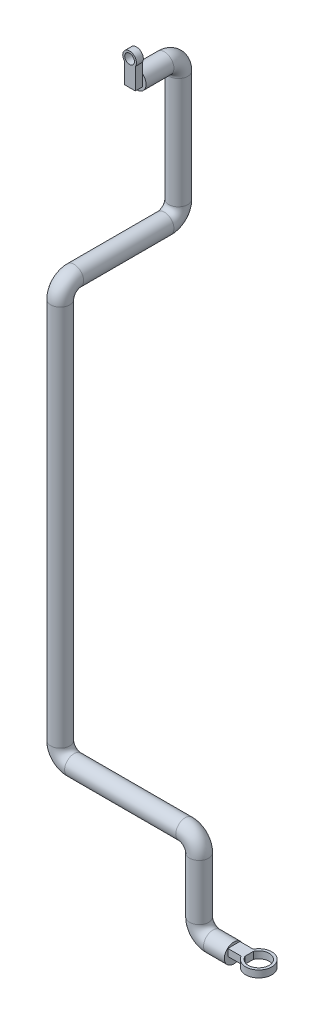
ISO-10303-21;
HEADER;
FILE_DESCRIPTION(('STEP AP214'),'2;1');
FILE_NAME('part.step','',(''),(''),'','','');
FILE_SCHEMA(('AUTOMOTIVE_DESIGN { 1 0 10303 214 1 1 1 1 }'));
ENDSEC;
DATA;
#1=APPLICATION_CONTEXT('core data for automotive mechanical design processes');
#2=APPLICATION_PROTOCOL_DEFINITION('international standard','automotive_design',2000,#1);
#3=PRODUCT_CONTEXT('',#1,'mechanical');
#4=PRODUCT('Part','Part','',(#3));
#5=PRODUCT_RELATED_PRODUCT_CATEGORY('part','',(#4));
#6=PRODUCT_DEFINITION_FORMATION('','',#4);
#7=PRODUCT_DEFINITION_CONTEXT('part definition',#1,'design');
#8=PRODUCT_DEFINITION('design','',#6,#7);
#9=PRODUCT_DEFINITION_SHAPE('','',#8);
#10=(LENGTH_UNIT() NAMED_UNIT(*) SI_UNIT(.MILLI.,.METRE.));
#11=(NAMED_UNIT(*) PLANE_ANGLE_UNIT() SI_UNIT($,.RADIAN.));
#12=(NAMED_UNIT(*) SI_UNIT($,.STERADIAN.) SOLID_ANGLE_UNIT());
#13=UNCERTAINTY_MEASURE_WITH_UNIT(LENGTH_MEASURE(1.E-05),#10,'distance_accuracy_value','');
#14=(GEOMETRIC_REPRESENTATION_CONTEXT(3) GLOBAL_UNCERTAINTY_ASSIGNED_CONTEXT((#13)) GLOBAL_UNIT_ASSIGNED_CONTEXT((#10,
#11,#12)) REPRESENTATION_CONTEXT('',''));
#15=CARTESIAN_POINT('',(0.,0.,0.));
#16=DIRECTION('',(0.,0.,1.));
#17=DIRECTION('',(1.,0.,0.));
#18=AXIS2_PLACEMENT_3D('',#15,#16,#17);
#19=CARTESIAN_POINT('',(-250.,910.,-150.));
#20=DIRECTION('',(0.,0.,1.));
#21=DIRECTION('',(1.,0.,0.));
#22=AXIS2_PLACEMENT_3D('',#19,#20,#21);
#23=CYLINDRICAL_SURFACE('',#22,13.7);
#24=CARTESIAN_POINT('',(-250.,910.,-150.));
#25=DIRECTION('',(0.,0.,-1.));
#26=DIRECTION('',(0.,1.,0.));
#27=AXIS2_PLACEMENT_3D('',#24,#25,#26);
#28=CIRCLE('',#27,13.7);
#29=CARTESIAN_POINT('',(-250.,923.7,-150.));
#30=VERTEX_POINT('',#29);
#31=EDGE_CURVE('E149',#30,#30,#28,.T.);
#32=ORIENTED_EDGE('',*,*,#31,.F.);
#33=EDGE_LOOP('',(#32));
#34=FACE_BOUND('',#33,.T.);
#35=CARTESIAN_POINT('',(-250.,910.,-109.847357520485));
#36=DIRECTION('',(0.,0.,1.));
#37=DIRECTION('',(1.,0.,0.));
#38=AXIS2_PLACEMENT_3D('',#35,#36,#37);
#39=CIRCLE('',#38,13.7);
#40=CARTESIAN_POINT('',(-241.746737265848,920.934973902166,-109.847357520485));
#41=VERTEX_POINT('',#40);
#42=CARTESIAN_POINT('',(-256.956251406481,921.802566092585,-109.847357520485));
#43=VERTEX_POINT('',#42);
#44=EDGE_CURVE('E131',#41,#43,#39,.T.);
#45=ORIENTED_EDGE('',*,*,#44,.F.);
#46=CARTESIAN_POINT('',(-250.,910.,-109.847357520485));
#47=DIRECTION('',(0.,0.,-1.));
#48=DIRECTION('',(0.,1.,0.));
#49=AXIS2_PLACEMENT_3D('',#46,#47,#48);
#50=CIRCLE('',#49,13.7);
#51=EDGE_CURVE('E142',#41,#43,#50,.T.);
#52=ORIENTED_EDGE('',*,*,#51,.T.);
#53=EDGE_LOOP('',(#45,#52));
#54=FACE_BOUND('',#53,.T.);
#55=ADVANCED_FACE('F36',(#34,#54),#23,.T.);
#56=CARTESIAN_POINT('',(-250.,910.,-109.847357520485));
#57=DIRECTION('',(0.,0.,-1.));
#58=DIRECTION('',(0.,1.,0.));
#59=AXIS2_PLACEMENT_3D('',#56,#57,#58);
#60=PLANE('',#59);
#61=DIRECTION('',(0.,1.,0.));
#62=VECTOR('',#61,1.);
#63=CARTESIAN_POINT('',(-241.746737265848,904.048678117426,-109.847357520485));
#64=LINE('',#63,#62);
#65=CARTESIAN_POINT('',(-241.746737265848,904.048678117426,-109.847357520485));
#66=VERTEX_POINT('',#65);
#67=EDGE_CURVE('E51',#66,#41,#64,.T.);
#68=ORIENTED_EDGE('',*,*,#67,.F.);
#69=DIRECTION('',(1.,0.,0.));
#70=VECTOR('',#69,1.);
#71=CARTESIAN_POINT('',(-256.956251406481,904.048678117426,-109.847357520485));
#72=LINE('',#71,#70);
#73=CARTESIAN_POINT('',(-256.956251406481,904.048678117426,-109.847357520485));
#74=VERTEX_POINT('',#73);
#75=EDGE_CURVE('E144',#74,#66,#72,.T.);
#76=ORIENTED_EDGE('',*,*,#75,.F.);
#77=DIRECTION('',(0.,-1.,0.));
#78=VECTOR('',#77,1.);
#79=CARTESIAN_POINT('',(-256.956251406481,921.802566092585,-109.847357520485));
#80=LINE('',#79,#78);
#81=EDGE_CURVE('E127',#43,#74,#80,.T.);
#82=ORIENTED_EDGE('',*,*,#81,.F.);
#83=ORIENTED_EDGE('',*,*,#51,.F.);
#84=EDGE_LOOP('',(#68,#76,#82,#83));
#85=FACE_BOUND('',#84,.T.);
#86=ADVANCED_FACE('F141',(#85),#60,.F.);
#87=CARTESIAN_POINT('',(-22.0679444600556,10.,-8.65554676919267));
#88=DIRECTION('',(0.,0.,1.));
#89=DIRECTION('',(1.,0.,0.));
#90=AXIS2_PLACEMENT_3D('',#87,#88,#89);
#91=PLANE('',#90);
#92=DIRECTION('',(0.,-1.,0.));
#93=VECTOR('',#92,1.);
#94=CARTESIAN_POINT('',(19.1374964660109,10.,-8.65554676919267));
#95=LINE('',#94,#93);
#96=CARTESIAN_POINT('',(19.1374964660109,0.,-8.65554676919267));
#97=VERTEX_POINT('',#96);
#98=CARTESIAN_POINT('',(19.1374964660109,10.,-8.65554676919267));
#99=VERTEX_POINT('',#98);
#100=EDGE_CURVE('E172',#97,#99,#95,.F.);
#101=ORIENTED_EDGE('',*,*,#100,.F.);
#102=DIRECTION('',(-1.,0.,0.));
#103=VECTOR('',#102,1.);
#104=CARTESIAN_POINT('',(-22.0679444600556,0.,-8.65554676919267));
#105=LINE('',#104,#103);
#106=CARTESIAN_POINT('',(0.,0.,-8.65554676919267));
#107=VERTEX_POINT('',#106);
#108=EDGE_CURVE('E171',#97,#107,#105,.T.);
#109=ORIENTED_EDGE('',*,*,#108,.T.);
#110=DIRECTION('',(0.,-1.,0.));
#111=VECTOR('',#110,1.);
#112=CARTESIAN_POINT('',(0.,0.,-8.65554676919267));
#113=LINE('',#112,#111);
#114=CARTESIAN_POINT('',(0.,10.,-8.65554676919267));
#115=VERTEX_POINT('',#114);
#116=EDGE_CURVE('E44',#115,#107,#113,.T.);
#117=ORIENTED_EDGE('',*,*,#116,.F.);
#118=DIRECTION('',(-1.,0.,0.));
#119=VECTOR('',#118,1.);
#120=CARTESIAN_POINT('',(-22.0679444600556,10.,-8.65554676919267));
#121=LINE('',#120,#119);
#122=EDGE_CURVE('E168',#99,#115,#121,.T.);
#123=ORIENTED_EDGE('',*,*,#122,.F.);
#124=EDGE_LOOP('',(#101,#109,#117,#123));
#125=FACE_BOUND('',#124,.T.);
#126=ADVANCED_FACE('F167',(#125),#91,.F.);
#127=CARTESIAN_POINT('',(-22.0679444600556,10.,8.65554676919267));
#128=DIRECTION('',(0.,0.,-1.));
#129=DIRECTION('',(-1.,0.,0.));
#130=AXIS2_PLACEMENT_3D('',#127,#128,#129);
#131=PLANE('',#130);
#132=DIRECTION('',(0.,-1.,0.));
#133=VECTOR('',#132,1.);
#134=CARTESIAN_POINT('',(19.1374964660109,10.,8.65554676919267));
#135=LINE('',#134,#133);
#136=CARTESIAN_POINT('',(19.1374964660109,10.,8.65554676919267));
#137=VERTEX_POINT('',#136);
#138=CARTESIAN_POINT('',(19.1374964660109,0.,8.65554676919267));
#139=VERTEX_POINT('',#138);
#140=EDGE_CURVE('E190',#137,#139,#135,.T.);
#141=ORIENTED_EDGE('',*,*,#140,.F.);
#142=DIRECTION('',(1.,0.,0.));
#143=VECTOR('',#142,1.);
#144=CARTESIAN_POINT('',(-22.0679444600556,10.,8.65554676919267));
#145=LINE('',#144,#143);
#146=CARTESIAN_POINT('',(0.,10.,8.65554676919267));
#147=VERTEX_POINT('',#146);
#148=EDGE_CURVE('E189',#147,#137,#145,.T.);
#149=ORIENTED_EDGE('',*,*,#148,.F.);
#150=DIRECTION('',(0.,1.,0.));
#151=VECTOR('',#150,1.);
#152=CARTESIAN_POINT('',(0.,0.,8.65554676919267));
#153=LINE('',#152,#151);
#154=CARTESIAN_POINT('',(0.,0.,8.65554676919267));
#155=VERTEX_POINT('',#154);
#156=EDGE_CURVE('E152',#155,#147,#153,.T.);
#157=ORIENTED_EDGE('',*,*,#156,.F.);
#158=DIRECTION('',(1.,0.,0.));
#159=VECTOR('',#158,1.);
#160=CARTESIAN_POINT('',(-22.0679444600556,0.,8.65554676919267));
#161=LINE('',#160,#159);
#162=EDGE_CURVE('E176',#155,#139,#161,.T.);
#163=ORIENTED_EDGE('',*,*,#162,.T.);
#164=EDGE_LOOP('',(#141,#149,#157,#163));
#165=FACE_BOUND('',#164,.T.);
#166=ADVANCED_FACE('F187',(#165),#131,.F.);
#167=CARTESIAN_POINT('',(0.,0.,0.));
#168=DIRECTION('',(1.,0.,0.));
#169=DIRECTION('',(0.,0.,-1.));
#170=AXIS2_PLACEMENT_3D('',#167,#168,#169);
#171=PLANE('',#170);
#172=DIRECTION('',(0.,0.,1.));
#173=VECTOR('',#172,1.);
#174=CARTESIAN_POINT('',(0.,10.,0.));
#175=LINE('',#174,#173);
#176=EDGE_CURVE('E11',#115,#147,#175,.T.);
#177=ORIENTED_EDGE('',*,*,#176,.F.);
#178=ORIENTED_EDGE('',*,*,#116,.T.);
#179=DIRECTION('',(0.,0.,1.));
#180=VECTOR('',#179,1.);
#181=CARTESIAN_POINT('',(0.,0.,0.));
#182=LINE('',#181,#180);
#183=EDGE_CURVE('E148',#107,#155,#182,.T.);
#184=ORIENTED_EDGE('',*,*,#183,.T.);
#185=ORIENTED_EDGE('',*,*,#156,.T.);
#186=EDGE_LOOP('',(#177,#178,#184,#185));
#187=FACE_BOUND('',#186,.T.);
#188=CARTESIAN_POINT('',(0.,0.,0.));
#189=DIRECTION('',(1.,0.,0.));
#190=DIRECTION('',(0.,0.,-1.));
#191=AXIS2_PLACEMENT_3D('',#188,#189,#190);
#192=CIRCLE('',#191,13.7);
#193=CARTESIAN_POINT('',(0.,0.,-13.7));
#194=VERTEX_POINT('',#193);
#195=EDGE_CURVE('E194',#194,#194,#192,.T.);
#196=ORIENTED_EDGE('',*,*,#195,.T.);
#197=EDGE_LOOP('',(#196));
#198=FACE_BOUND('',#197,.T.);
#199=ADVANCED_FACE('F38',(#187,#198),#171,.T.);
#200=CARTESIAN_POINT('',(0.,0.,0.));
#201=DIRECTION('',(-1.,0.,0.));
#202=DIRECTION('',(0.,0.,1.));
#203=AXIS2_PLACEMENT_3D('',#200,#201,#202);
#204=CYLINDRICAL_SURFACE('',#203,13.7);
#205=CARTESIAN_POINT('',(-30.,0.,0.));
#206=DIRECTION('',(1.,0.,0.));
#207=DIRECTION('',(0.,0.,-1.));
#208=AXIS2_PLACEMENT_3D('',#205,#206,#207);
#209=CIRCLE('',#208,13.7);
#210=CARTESIAN_POINT('',(-30.,-13.7,0.));
#211=VERTEX_POINT('',#210);
#212=EDGE_CURVE('E197',#211,#211,#209,.T.);
#213=ORIENTED_EDGE('',*,*,#212,.T.);
#214=EDGE_LOOP('',(#213));
#215=FACE_BOUND('',#214,.T.);
#216=ORIENTED_EDGE('',*,*,#195,.F.);
#217=EDGE_LOOP('',(#216));
#218=FACE_BOUND('',#217,.T.);
#219=ADVANCED_FACE('F267',(#215,#218),#204,.T.);
#220=CARTESIAN_POINT('',(-30.,20.,0.));
#221=DIRECTION('',(0.,0.,-1.));
#222=DIRECTION('',(-1.,0.,0.));
#223=AXIS2_PLACEMENT_3D('',#220,#221,#222);
#224=TOROIDAL_SURFACE('',#223,20.,13.7);
#225=CARTESIAN_POINT('',(-50.,20.,0.));
#226=DIRECTION('',(0.,-1.,0.));
#227=DIRECTION('',(0.,0.,-1.));
#228=AXIS2_PLACEMENT_3D('',#225,#226,#227);
#229=CIRCLE('',#228,13.7);
#230=CARTESIAN_POINT('',(-63.7,20.,0.));
#231=VERTEX_POINT('',#230);
#232=EDGE_CURVE('E205',#231,#231,#229,.T.);
#233=CARTESIAN_POINT('',(-30.,20.,0.));
#234=DIRECTION('',(0.,0.,-1.));
#235=DIRECTION('',(-1.,0.,0.));
#236=AXIS2_PLACEMENT_3D('',#233,#234,#235);
#237=CIRCLE('',#236,33.7);
#238=EDGE_CURVE('',#211,#231,#237,.T.);
#239=ORIENTED_EDGE('',*,*,#212,.F.);
#240=ORIENTED_EDGE('',*,*,#232,.T.);
#241=ORIENTED_EDGE('',*,*,#238,.T.);
#242=ORIENTED_EDGE('',*,*,#238,.F.);
#243=EDGE_LOOP('',(#239,#241,#240,#242));
#244=FACE_BOUND('',#243,.T.);
#245=ADVANCED_FACE('F270',(#244),#224,.T.);
#246=CARTESIAN_POINT('',(-50.,20.,0.));
#247=DIRECTION('',(0.,1.,0.));
#248=DIRECTION('',(0.,0.,1.));
#249=AXIS2_PLACEMENT_3D('',#246,#247,#248);
#250=CYLINDRICAL_SURFACE('',#249,13.7);
#251=CARTESIAN_POINT('',(-50.,100.,0.));
#252=DIRECTION('',(0.,-1.,0.));
#253=DIRECTION('',(0.,0.,-1.));
#254=AXIS2_PLACEMENT_3D('',#251,#252,#253);
#255=CIRCLE('',#254,13.7);
#256=CARTESIAN_POINT('',(-36.3,100.,0.));
#257=VERTEX_POINT('',#256);
#258=EDGE_CURVE('E208',#257,#257,#255,.T.);
#259=ORIENTED_EDGE('',*,*,#258,.T.);
#260=EDGE_LOOP('',(#259));
#261=FACE_BOUND('',#260,.T.);
#262=ORIENTED_EDGE('',*,*,#232,.F.);
#263=EDGE_LOOP('',(#262));
#264=FACE_BOUND('',#263,.T.);
#265=ADVANCED_FACE('F274',(#261,#264),#250,.T.);
#266=CARTESIAN_POINT('',(-70.,100.,0.));
#267=DIRECTION('',(0.,0.,1.));
#268=DIRECTION('',(1.,0.,0.));
#269=AXIS2_PLACEMENT_3D('',#266,#267,#268);
#270=TOROIDAL_SURFACE('',#269,20.,13.7);
#271=CARTESIAN_POINT('',(-70.,120.,0.));
#272=DIRECTION('',(1.,0.,0.));
#273=DIRECTION('',(0.,0.,-1.));
#274=AXIS2_PLACEMENT_3D('',#271,#272,#273);
#275=CIRCLE('',#274,13.7);
#276=CARTESIAN_POINT('',(-70.,133.7,0.));
#277=VERTEX_POINT('',#276);
#278=EDGE_CURVE('E211',#277,#277,#275,.T.);
#279=CARTESIAN_POINT('',(-70.,100.,0.));
#280=DIRECTION('',(0.,0.,1.));
#281=DIRECTION('',(1.,0.,0.));
#282=AXIS2_PLACEMENT_3D('',#279,#280,#281);
#283=CIRCLE('',#282,33.7);
#284=EDGE_CURVE('',#257,#277,#283,.T.);
#285=ORIENTED_EDGE('',*,*,#258,.F.);
#286=ORIENTED_EDGE('',*,*,#278,.T.);
#287=ORIENTED_EDGE('',*,*,#284,.T.);
#288=ORIENTED_EDGE('',*,*,#284,.F.);
#289=EDGE_LOOP('',(#285,#287,#286,#288));
#290=FACE_BOUND('',#289,.T.);
#291=ADVANCED_FACE('F278',(#290),#270,.T.);
#292=CARTESIAN_POINT('',(-70.,120.,0.));
#293=DIRECTION('',(-1.,0.,0.));
#294=DIRECTION('',(0.,0.,1.));
#295=AXIS2_PLACEMENT_3D('',#292,#293,#294);
#296=CYLINDRICAL_SURFACE('',#295,13.7);
#297=CARTESIAN_POINT('',(-230.,120.,0.));
#298=DIRECTION('',(1.,0.,0.));
#299=DIRECTION('',(0.,0.,-1.));
#300=AXIS2_PLACEMENT_3D('',#297,#298,#299);
#301=CIRCLE('',#300,13.7);
#302=CARTESIAN_POINT('',(-230.,106.3,0.));
#303=VERTEX_POINT('',#302);
#304=EDGE_CURVE('E214',#303,#303,#301,.T.);
#305=ORIENTED_EDGE('',*,*,#304,.T.);
#306=EDGE_LOOP('',(#305));
#307=FACE_BOUND('',#306,.T.);
#308=ORIENTED_EDGE('',*,*,#278,.F.);
#309=EDGE_LOOP('',(#308));
#310=FACE_BOUND('',#309,.T.);
#311=ADVANCED_FACE('F282',(#307,#310),#296,.T.);
#312=CARTESIAN_POINT('',(-230.,140.,0.));
#313=DIRECTION('',(0.,0.,-1.));
#314=DIRECTION('',(-1.,0.,0.));
#315=AXIS2_PLACEMENT_3D('',#312,#313,#314);
#316=TOROIDAL_SURFACE('',#315,20.,13.7);
#317=CARTESIAN_POINT('',(-250.,140.,0.));
#318=DIRECTION('',(0.,-1.,0.));
#319=DIRECTION('',(0.,0.,-1.));
#320=AXIS2_PLACEMENT_3D('',#317,#318,#319);
#321=CIRCLE('',#320,13.7);
#322=CARTESIAN_POINT('',(-263.7,140.,0.));
#323=VERTEX_POINT('',#322);
#324=EDGE_CURVE('E217',#323,#323,#321,.T.);
#325=CARTESIAN_POINT('',(-230.,140.,0.));
#326=DIRECTION('',(0.,0.,-1.));
#327=DIRECTION('',(-1.,0.,0.));
#328=AXIS2_PLACEMENT_3D('',#325,#326,#327);
#329=CIRCLE('',#328,33.7);
#330=EDGE_CURVE('',#303,#323,#329,.T.);
#331=ORIENTED_EDGE('',*,*,#304,.F.);
#332=ORIENTED_EDGE('',*,*,#324,.T.);
#333=ORIENTED_EDGE('',*,*,#330,.T.);
#334=ORIENTED_EDGE('',*,*,#330,.F.);
#335=EDGE_LOOP('',(#331,#333,#332,#334));
#336=FACE_BOUND('',#335,.T.);
#337=ADVANCED_FACE('F286',(#336),#316,.T.);
#338=CARTESIAN_POINT('',(-250.,140.,0.));
#339=DIRECTION('',(0.,1.,0.));
#340=DIRECTION('',(-1.,0.,0.));
#341=AXIS2_PLACEMENT_3D('',#338,#339,#340);
#342=CYLINDRICAL_SURFACE('',#341,13.7);
#343=CARTESIAN_POINT('',(-250.,690.,0.));
#344=DIRECTION('',(0.,-1.,0.));
#345=DIRECTION('',(0.,0.,-1.));
#346=AXIS2_PLACEMENT_3D('',#343,#344,#345);
#347=CIRCLE('',#346,13.7);
#348=CARTESIAN_POINT('',(-250.,690.,13.7));
#349=VERTEX_POINT('',#348);
#350=EDGE_CURVE('E220',#349,#349,#347,.T.);
#351=ORIENTED_EDGE('',*,*,#350,.T.);
#352=EDGE_LOOP('',(#351));
#353=FACE_BOUND('',#352,.T.);
#354=ORIENTED_EDGE('',*,*,#324,.F.);
#355=EDGE_LOOP('',(#354));
#356=FACE_BOUND('',#355,.T.);
#357=ADVANCED_FACE('F290',(#353,#356),#342,.T.);
#358=CARTESIAN_POINT('',(-250.,690.,-20.));
#359=DIRECTION('',(-1.,0.,0.));
#360=DIRECTION('',(0.,0.,1.));
#361=AXIS2_PLACEMENT_3D('',#358,#359,#360);
#362=TOROIDAL_SURFACE('',#361,20.,13.7);
#363=CARTESIAN_POINT('',(-250.,710.,-20.));
#364=DIRECTION('',(0.,0.,1.));
#365=DIRECTION('',(0.,-1.,0.));
#366=AXIS2_PLACEMENT_3D('',#363,#364,#365);
#367=CIRCLE('',#366,13.7);
#368=CARTESIAN_POINT('',(-250.,723.7,-20.));
#369=VERTEX_POINT('',#368);
#370=EDGE_CURVE('E223',#369,#369,#367,.T.);
#371=CARTESIAN_POINT('',(-250.,690.,-20.));
#372=DIRECTION('',(-1.,0.,0.));
#373=DIRECTION('',(0.,0.,1.));
#374=AXIS2_PLACEMENT_3D('',#371,#372,#373);
#375=CIRCLE('',#374,33.7);
#376=EDGE_CURVE('',#349,#369,#375,.T.);
#377=ORIENTED_EDGE('',*,*,#350,.F.);
#378=ORIENTED_EDGE('',*,*,#370,.T.);
#379=ORIENTED_EDGE('',*,*,#376,.T.);
#380=ORIENTED_EDGE('',*,*,#376,.F.);
#381=EDGE_LOOP('',(#377,#379,#378,#380));
#382=FACE_BOUND('',#381,.T.);
#383=ADVANCED_FACE('F294',(#382),#362,.T.);
#384=CARTESIAN_POINT('',(-250.,710.,-20.));
#385=DIRECTION('',(0.,0.,-1.));
#386=DIRECTION('',(-1.,0.,0.));
#387=AXIS2_PLACEMENT_3D('',#384,#385,#386);
#388=CYLINDRICAL_SURFACE('',#387,13.7);
#389=CARTESIAN_POINT('',(-250.,710.,-150.));
#390=DIRECTION('',(0.,0.,1.));
#391=DIRECTION('',(0.,-1.,0.));
#392=AXIS2_PLACEMENT_3D('',#389,#390,#391);
#393=CIRCLE('',#392,13.7);
#394=CARTESIAN_POINT('',(-250.,696.3,-150.));
#395=VERTEX_POINT('',#394);
#396=EDGE_CURVE('E226',#395,#395,#393,.T.);
#397=ORIENTED_EDGE('',*,*,#396,.T.);
#398=EDGE_LOOP('',(#397));
#399=FACE_BOUND('',#398,.T.);
#400=ORIENTED_EDGE('',*,*,#370,.F.);
#401=EDGE_LOOP('',(#400));
#402=FACE_BOUND('',#401,.T.);
#403=ADVANCED_FACE('F298',(#399,#402),#388,.T.);
#404=CARTESIAN_POINT('',(-250.,730.,-150.));
#405=DIRECTION('',(1.,0.,0.));
#406=DIRECTION('',(0.,0.,-1.));
#407=AXIS2_PLACEMENT_3D('',#404,#405,#406);
#408=TOROIDAL_SURFACE('',#407,20.,13.7);
#409=CARTESIAN_POINT('',(-250.,730.,-170.));
#410=DIRECTION('',(0.,-1.,0.));
#411=DIRECTION('',(0.,0.,-1.));
#412=AXIS2_PLACEMENT_3D('',#409,#410,#411);
#413=CIRCLE('',#412,13.7);
#414=CARTESIAN_POINT('',(-250.,730.,-183.7));
#415=VERTEX_POINT('',#414);
#416=EDGE_CURVE('E229',#415,#415,#413,.T.);
#417=CARTESIAN_POINT('',(-250.,730.,-150.));
#418=DIRECTION('',(1.,0.,0.));
#419=DIRECTION('',(0.,0.,-1.));
#420=AXIS2_PLACEMENT_3D('',#417,#418,#419);
#421=CIRCLE('',#420,33.7);
#422=EDGE_CURVE('',#395,#415,#421,.T.);
#423=ORIENTED_EDGE('',*,*,#396,.F.);
#424=ORIENTED_EDGE('',*,*,#416,.T.);
#425=ORIENTED_EDGE('',*,*,#422,.T.);
#426=ORIENTED_EDGE('',*,*,#422,.F.);
#427=EDGE_LOOP('',(#423,#425,#424,#426));
#428=FACE_BOUND('',#427,.T.);
#429=ADVANCED_FACE('F248',(#428),#408,.T.);
#430=CARTESIAN_POINT('',(-250.,730.,-170.));
#431=DIRECTION('',(0.,1.,0.));
#432=DIRECTION('',(0.,0.,1.));
#433=AXIS2_PLACEMENT_3D('',#430,#431,#432);
#434=CYLINDRICAL_SURFACE('',#433,13.7);
#435=CARTESIAN_POINT('',(-250.,890.,-170.));
#436=DIRECTION('',(0.,-1.,0.));
#437=DIRECTION('',(0.,0.,-1.));
#438=AXIS2_PLACEMENT_3D('',#435,#436,#437);
#439=CIRCLE('',#438,13.7);
#440=CARTESIAN_POINT('',(-250.,890.,-183.7));
#441=VERTEX_POINT('',#440);
#442=EDGE_CURVE('E155',#441,#441,#439,.T.);
#443=ORIENTED_EDGE('',*,*,#442,.T.);
#444=EDGE_LOOP('',(#443));
#445=FACE_BOUND('',#444,.T.);
#446=ORIENTED_EDGE('',*,*,#416,.F.);
#447=EDGE_LOOP('',(#446));
#448=FACE_BOUND('',#447,.T.);
#449=ADVANCED_FACE('F234',(#445,#448),#434,.T.);
#450=CARTESIAN_POINT('',(-250.,890.,-150.));
#451=DIRECTION('',(1.,0.,0.));
#452=DIRECTION('',(0.,0.,-1.));
#453=AXIS2_PLACEMENT_3D('',#450,#451,#452);
#454=TOROIDAL_SURFACE('',#453,20.,13.7);
#455=CARTESIAN_POINT('',(-250.,890.,-150.));
#456=DIRECTION('',(1.,0.,0.));
#457=DIRECTION('',(0.,0.,-1.));
#458=AXIS2_PLACEMENT_3D('',#455,#456,#457);
#459=CIRCLE('',#458,33.7);
#460=EDGE_CURVE('',#441,#30,#459,.T.);
#461=ORIENTED_EDGE('',*,*,#442,.F.);
#462=ORIENTED_EDGE('',*,*,#31,.T.);
#463=ORIENTED_EDGE('',*,*,#460,.T.);
#464=ORIENTED_EDGE('',*,*,#460,.F.);
#465=EDGE_LOOP('',(#461,#463,#462,#464));
#466=FACE_BOUND('',#465,.T.);
#467=ADVANCED_FACE('F237',(#466),#454,.T.);
#468=CARTESIAN_POINT('',(22.0679444600556,10.,-8.65554676919267));
#469=DIRECTION('',(-1.,0.,0.));
#470=DIRECTION('',(0.,0.,1.));
#471=AXIS2_PLACEMENT_3D('',#468,#469,#470);
#472=PLANE('',#471);
#473=DIRECTION('',(0.,0.,-1.));
#474=VECTOR('',#473,1.);
#475=CARTESIAN_POINT('',(22.0679444600556,0.,-8.65554676919267));
#476=LINE('',#475,#474);
#477=CARTESIAN_POINT('',(22.0679444600556,0.,5.96908557180264));
#478=VERTEX_POINT('',#477);
#479=CARTESIAN_POINT('',(22.0679444600556,0.,-5.96908557180264));
#480=VERTEX_POINT('',#479);
#481=EDGE_CURVE('E177',#478,#480,#476,.T.);
#482=ORIENTED_EDGE('',*,*,#481,.T.);
#483=DIRECTION('',(0.,-1.,0.));
#484=VECTOR('',#483,1.);
#485=CARTESIAN_POINT('',(22.0679444600556,10.,-5.96908557180264));
#486=LINE('',#485,#484);
#487=CARTESIAN_POINT('',(22.0679444600556,10.,-5.96908557180264));
#488=VERTEX_POINT('',#487);
#489=EDGE_CURVE('E59',#480,#488,#486,.F.);
#490=ORIENTED_EDGE('',*,*,#489,.T.);
#491=DIRECTION('',(0.,0.,-1.));
#492=VECTOR('',#491,1.);
#493=CARTESIAN_POINT('',(22.0679444600556,10.,-8.65554676919267));
#494=LINE('',#493,#492);
#495=CARTESIAN_POINT('',(22.0679444600556,10.,5.96908557180264));
#496=VERTEX_POINT('',#495);
#497=EDGE_CURVE('E184',#496,#488,#494,.T.);
#498=ORIENTED_EDGE('',*,*,#497,.F.);
#499=DIRECTION('',(0.,-1.,0.));
#500=VECTOR('',#499,1.);
#501=CARTESIAN_POINT('',(22.0679444600556,10.,5.96908557180264));
#502=LINE('',#501,#500);
#503=EDGE_CURVE('E551',#496,#478,#502,.T.);
#504=ORIENTED_EDGE('',*,*,#503,.T.);
#505=EDGE_LOOP('',(#482,#490,#498,#504));
#506=FACE_BOUND('',#505,.T.);
#507=ADVANCED_FACE('F239',(#506),#472,.F.);
#508=CARTESIAN_POINT('',(0.,10.,0.));
#509=DIRECTION('',(0.,1.,0.));
#510=DIRECTION('',(0.,0.,1.));
#511=AXIS2_PLACEMENT_3D('',#508,#509,#510);
#512=PLANE('',#511);
#513=CARTESIAN_POINT('',(35.8291223688139,10.,0.));
#514=DIRECTION('',(0.,1.,0.));
#515=DIRECTION('',(0.,0.,1.));
#516=AXIS2_PLACEMENT_3D('',#513,#514,#515);
#517=CIRCLE('',#516,15.);
#518=EDGE_CURVE('E549',#496,#488,#517,.T.);
#519=ORIENTED_EDGE('',*,*,#518,.F.);
#520=ORIENTED_EDGE('',*,*,#497,.T.);
#521=EDGE_LOOP('',(#519,#520));
#522=FACE_BOUND('',#521,.T.);
#523=CARTESIAN_POINT('',(35.8291223688139,10.,0.));
#524=DIRECTION('',(0.,1.,0.));
#525=DIRECTION('',(0.,0.,1.));
#526=AXIS2_PLACEMENT_3D('',#523,#524,#525);
#527=CIRCLE('',#526,18.8023632863745);
#528=EDGE_CURVE('E548',#137,#99,#527,.T.);
#529=ORIENTED_EDGE('',*,*,#528,.T.);
#530=ORIENTED_EDGE('',*,*,#122,.T.);
#531=ORIENTED_EDGE('',*,*,#176,.T.);
#532=ORIENTED_EDGE('',*,*,#148,.T.);
#533=EDGE_LOOP('',(#529,#530,#531,#532));
#534=FACE_BOUND('',#533,.T.);
#535=ADVANCED_FACE('F246',(#522,#534),#512,.T.);
#536=CARTESIAN_POINT('',(0.,0.,0.));
#537=DIRECTION('',(0.,1.,0.));
#538=DIRECTION('',(0.,0.,1.));
#539=AXIS2_PLACEMENT_3D('',#536,#537,#538);
#540=PLANE('',#539);
#541=ORIENTED_EDGE('',*,*,#481,.F.);
#542=CARTESIAN_POINT('',(35.8291223688139,0.,0.));
#543=DIRECTION('',(0.,1.,0.));
#544=DIRECTION('',(0.,0.,1.));
#545=AXIS2_PLACEMENT_3D('',#542,#543,#544);
#546=CIRCLE('',#545,15.);
#547=EDGE_CURVE('E554',#478,#480,#546,.T.);
#548=ORIENTED_EDGE('',*,*,#547,.T.);
#549=EDGE_LOOP('',(#541,#548));
#550=FACE_BOUND('',#549,.T.);
#551=ORIENTED_EDGE('',*,*,#108,.F.);
#552=CARTESIAN_POINT('',(35.8291223688139,0.,0.));
#553=DIRECTION('',(0.,1.,0.));
#554=DIRECTION('',(0.,0.,1.));
#555=AXIS2_PLACEMENT_3D('',#552,#553,#554);
#556=CIRCLE('',#555,18.8023632863745);
#557=EDGE_CURVE('E181',#139,#97,#556,.T.);
#558=ORIENTED_EDGE('',*,*,#557,.F.);
#559=ORIENTED_EDGE('',*,*,#162,.F.);
#560=ORIENTED_EDGE('',*,*,#183,.F.);
#561=EDGE_LOOP('',(#551,#558,#559,#560));
#562=FACE_BOUND('',#561,.T.);
#563=ADVANCED_FACE('F179',(#550,#562),#540,.F.);
#564=CARTESIAN_POINT('',(35.8291223688139,10.,0.));
#565=DIRECTION('',(0.,-1.,0.));
#566=DIRECTION('',(0.,0.,-1.));
#567=AXIS2_PLACEMENT_3D('',#564,#565,#566);
#568=CYLINDRICAL_SURFACE('',#567,18.8023632863745);
#569=ORIENTED_EDGE('',*,*,#557,.T.);
#570=ORIENTED_EDGE('',*,*,#100,.T.);
#571=ORIENTED_EDGE('',*,*,#528,.F.);
#572=ORIENTED_EDGE('',*,*,#140,.T.);
#573=EDGE_LOOP('',(#569,#570,#571,#572));
#574=FACE_BOUND('',#573,.T.);
#575=ADVANCED_FACE('F424',(#574),#568,.T.);
#576=CARTESIAN_POINT('',(35.8291223688139,10.,0.));
#577=DIRECTION('',(0.,-1.,0.));
#578=DIRECTION('',(0.,0.,-1.));
#579=AXIS2_PLACEMENT_3D('',#576,#577,#578);
#580=CYLINDRICAL_SURFACE('',#579,15.);
#581=ORIENTED_EDGE('',*,*,#489,.F.);
#582=ORIENTED_EDGE('',*,*,#547,.F.);
#583=ORIENTED_EDGE('',*,*,#503,.F.);
#584=ORIENTED_EDGE('',*,*,#518,.T.);
#585=EDGE_LOOP('',(#581,#582,#583,#584));
#586=FACE_BOUND('',#585,.T.);
#587=ADVANCED_FACE('F505',(#586),#580,.F.);
#588=CARTESIAN_POINT('',(-241.746737265848,904.048678117426,-109.847357520485));
#589=DIRECTION('',(1.,0.,0.));
#590=DIRECTION('',(0.,0.,-1.));
#591=AXIS2_PLACEMENT_3D('',#588,#589,#590);
#592=PLANE('',#591);
#593=DIRECTION('',(0.,1.,0.));
#594=VECTOR('',#593,1.);
#595=CARTESIAN_POINT('',(-241.746737265848,904.048678117426,-99.8473575204847));
#596=LINE('',#595,#594);
#597=CARTESIAN_POINT('',(-241.746737265848,904.048678117426,-99.8473575204847));
#598=VERTEX_POINT('',#597);
#599=CARTESIAN_POINT('',(-241.746737265849,934.611446682657,-99.8473575204847));
#600=VERTEX_POINT('',#599);
#601=EDGE_CURVE('E146',#598,#600,#596,.T.);
#602=ORIENTED_EDGE('',*,*,#601,.F.);
#603=DIRECTION('',(0.,0.,1.));
#604=VECTOR('',#603,1.);
#605=CARTESIAN_POINT('',(-241.746737265848,904.048678117426,-109.847357520485));
#606=LINE('',#605,#604);
#607=EDGE_CURVE('E566',#66,#598,#606,.T.);
#608=ORIENTED_EDGE('',*,*,#607,.F.);
#609=ORIENTED_EDGE('',*,*,#67,.T.);
#610=DIRECTION('',(0.,1.,0.));
#611=VECTOR('',#610,1.);
#612=CARTESIAN_POINT('',(-241.746737265848,0.,-109.847357520485));
#613=LINE('',#612,#611);
#614=CARTESIAN_POINT('',(-241.746737265848,934.611446682657,-109.847357520485));
#615=VERTEX_POINT('',#614);
#616=EDGE_CURVE('E137',#41,#615,#613,.T.);
#617=ORIENTED_EDGE('',*,*,#616,.T.);
#618=DIRECTION('',(0.,0.,-1.));
#619=VECTOR('',#618,1.);
#620=CARTESIAN_POINT('',(-241.746737265848,934.611446682657,-99.8473575204847));
#621=LINE('',#620,#619);
#622=EDGE_CURVE('E590',#600,#615,#621,.T.);
#623=ORIENTED_EDGE('',*,*,#622,.F.);
#624=EDGE_LOOP('',(#602,#608,#609,#617,#623));
#625=FACE_BOUND('',#624,.T.);
#626=ADVANCED_FACE('F501',(#625),#592,.T.);
#627=CARTESIAN_POINT('',(-256.956251406481,904.048678117426,-109.847357520485));
#628=DIRECTION('',(0.,-1.,0.));
#629=DIRECTION('',(0.,0.,-1.));
#630=AXIS2_PLACEMENT_3D('',#627,#628,#629);
#631=PLANE('',#630);
#632=DIRECTION('',(1.,0.,0.));
#633=VECTOR('',#632,1.);
#634=CARTESIAN_POINT('',(-256.956251406481,904.048678117426,-99.8473575204847));
#635=LINE('',#634,#633);
#636=CARTESIAN_POINT('',(-256.956251406481,904.048678117426,-99.8473575204847));
#637=VERTEX_POINT('',#636);
#638=EDGE_CURVE('E572',#637,#598,#635,.T.);
#639=ORIENTED_EDGE('',*,*,#638,.F.);
#640=DIRECTION('',(0.,0.,1.));
#641=VECTOR('',#640,1.);
#642=CARTESIAN_POINT('',(-256.956251406481,904.048678117426,-109.847357520485));
#643=LINE('',#642,#641);
#644=EDGE_CURVE('E567',#74,#637,#643,.T.);
#645=ORIENTED_EDGE('',*,*,#644,.F.);
#646=ORIENTED_EDGE('',*,*,#75,.T.);
#647=ORIENTED_EDGE('',*,*,#607,.T.);
#648=EDGE_LOOP('',(#639,#645,#646,#647));
#649=FACE_BOUND('',#648,.T.);
#650=ADVANCED_FACE('F496',(#649),#631,.T.);
#651=CARTESIAN_POINT('',(-256.956251406481,921.802566092585,-109.847357520485));
#652=DIRECTION('',(-1.,0.,0.));
#653=DIRECTION('',(0.,0.,1.));
#654=AXIS2_PLACEMENT_3D('',#651,#652,#653);
#655=PLANE('',#654);
#656=DIRECTION('',(0.,-1.,0.));
#657=VECTOR('',#656,1.);
#658=CARTESIAN_POINT('',(-256.956251406481,921.802566092585,-99.8473575204847));
#659=LINE('',#658,#657);
#660=CARTESIAN_POINT('',(-256.956251406481,933.016919090931,-99.8473575204847));
#661=VERTEX_POINT('',#660);
#662=EDGE_CURVE('E575',#661,#637,#659,.T.);
#663=ORIENTED_EDGE('',*,*,#662,.F.);
#664=DIRECTION('',(0.,0.,-1.));
#665=VECTOR('',#664,1.);
#666=CARTESIAN_POINT('',(-256.956251406481,933.016919090931,-99.8473575204847));
#667=LINE('',#666,#665);
#668=CARTESIAN_POINT('',(-256.956251406481,933.016919090931,-109.847357520485));
#669=VERTEX_POINT('',#668);
#670=EDGE_CURVE('E129',#669,#661,#667,.F.);
#671=ORIENTED_EDGE('',*,*,#670,.F.);
#672=DIRECTION('',(0.,1.,0.));
#673=VECTOR('',#672,1.);
#674=CARTESIAN_POINT('',(-256.956251406481,0.,-109.847357520485));
#675=LINE('',#674,#673);
#676=EDGE_CURVE('E123',#43,#669,#675,.T.);
#677=ORIENTED_EDGE('',*,*,#676,.F.);
#678=ORIENTED_EDGE('',*,*,#81,.T.);
#679=ORIENTED_EDGE('',*,*,#644,.T.);
#680=EDGE_LOOP('',(#663,#671,#677,#678,#679));
#681=FACE_BOUND('',#680,.T.);
#682=ADVANCED_FACE('F125',(#681),#655,.T.);
#683=CARTESIAN_POINT('',(-250.,910.,-99.8473575204847));
#684=DIRECTION('',(0.,0.,1.));
#685=DIRECTION('',(1.,0.,0.));
#686=AXIS2_PLACEMENT_3D('',#683,#684,#685);
#687=PLANE('',#686);
#688=ORIENTED_EDGE('',*,*,#601,.T.);
#689=CARTESIAN_POINT('',(-250.,940.,-99.8473575204847));
#690=DIRECTION('',(0.,0.,1.));
#691=DIRECTION('',(1.,0.,0.));
#692=AXIS2_PLACEMENT_3D('',#689,#690,#691);
#693=CIRCLE('',#692,9.85661466289362);
#694=EDGE_CURVE('E581',#600,#661,#693,.T.);
#695=ORIENTED_EDGE('',*,*,#694,.T.);
#696=ORIENTED_EDGE('',*,*,#662,.T.);
#697=ORIENTED_EDGE('',*,*,#638,.T.);
#698=EDGE_LOOP('',(#688,#695,#696,#697));
#699=FACE_BOUND('',#698,.T.);
#700=CARTESIAN_POINT('',(-250.,940.,-99.8473575204847));
#701=DIRECTION('',(0.,0.,1.));
#702=DIRECTION('',(1.,0.,0.));
#703=AXIS2_PLACEMENT_3D('',#700,#701,#702);
#704=CIRCLE('',#703,7.00000000000002);
#705=CARTESIAN_POINT('',(-243.,940.,-99.8473575204847));
#706=VERTEX_POINT('',#705);
#707=EDGE_CURVE('E584',#706,#706,#704,.T.);
#708=ORIENTED_EDGE('',*,*,#707,.F.);
#709=EDGE_LOOP('',(#708));
#710=FACE_BOUND('',#709,.T.);
#711=ADVANCED_FACE('F451',(#699,#710),#687,.T.);
#712=CARTESIAN_POINT('',(-250.,940.,-109.847357520485));
#713=DIRECTION('',(0.,0.,1.));
#714=DIRECTION('',(1.,0.,0.));
#715=AXIS2_PLACEMENT_3D('',#712,#713,#714);
#716=PLANE('',#715);
#717=ORIENTED_EDGE('',*,*,#676,.T.);
#718=CARTESIAN_POINT('',(-250.,940.,-109.847357520485));
#719=DIRECTION('',(0.,0.,1.));
#720=DIRECTION('',(1.,0.,0.));
#721=AXIS2_PLACEMENT_3D('',#718,#719,#720);
#722=CIRCLE('',#721,9.85661466289362);
#723=EDGE_CURVE('E582',#615,#669,#722,.T.);
#724=ORIENTED_EDGE('',*,*,#723,.F.);
#725=ORIENTED_EDGE('',*,*,#616,.F.);
#726=ORIENTED_EDGE('',*,*,#44,.T.);
#727=EDGE_LOOP('',(#717,#724,#725,#726));
#728=FACE_BOUND('',#727,.T.);
#729=CARTESIAN_POINT('',(-250.,940.,-109.847357520485));
#730=DIRECTION('',(0.,0.,1.));
#731=DIRECTION('',(1.,0.,0.));
#732=AXIS2_PLACEMENT_3D('',#729,#730,#731);
#733=CIRCLE('',#732,7.00000000000002);
#734=CARTESIAN_POINT('',(-243.,940.,-109.847357520485));
#735=VERTEX_POINT('',#734);
#736=EDGE_CURVE('E587',#735,#735,#733,.T.);
#737=ORIENTED_EDGE('',*,*,#736,.T.);
#738=EDGE_LOOP('',(#737));
#739=FACE_BOUND('',#738,.T.);
#740=ADVANCED_FACE('F134',(#728,#739),#716,.F.);
#741=CARTESIAN_POINT('',(-250.,940.,-99.8473575204847));
#742=DIRECTION('',(0.,0.,-1.));
#743=DIRECTION('',(-1.,0.,0.));
#744=AXIS2_PLACEMENT_3D('',#741,#742,#743);
#745=CYLINDRICAL_SURFACE('',#744,9.85661466289362);
#746=ORIENTED_EDGE('',*,*,#723,.T.);
#747=ORIENTED_EDGE('',*,*,#670,.T.);
#748=ORIENTED_EDGE('',*,*,#694,.F.);
#749=ORIENTED_EDGE('',*,*,#622,.T.);
#750=EDGE_LOOP('',(#746,#747,#748,#749));
#751=FACE_BOUND('',#750,.T.);
#752=ADVANCED_FACE('F450',(#751),#745,.T.);
#753=CARTESIAN_POINT('',(-250.,940.,-99.8473575204847));
#754=DIRECTION('',(0.,0.,-1.));
#755=DIRECTION('',(-1.,0.,0.));
#756=AXIS2_PLACEMENT_3D('',#753,#754,#755);
#757=CYLINDRICAL_SURFACE('',#756,7.00000000000002);
#758=ORIENTED_EDGE('',*,*,#707,.T.);
#759=EDGE_LOOP('',(#758));
#760=FACE_BOUND('',#759,.T.);
#761=ORIENTED_EDGE('',*,*,#736,.F.);
#762=EDGE_LOOP('',(#761));
#763=FACE_BOUND('',#762,.T.);
#764=ADVANCED_FACE('F467',(#760,#763),#757,.F.);
#765=CLOSED_SHELL('',(#55,#86,#126,#166,#199,#219,#245,#265,#291,#311,#337,#357,#383,#403,#429,
#449,#467,#507,#535,#563,#575,#587,#626,#650,#682,#711,#740,#752,#764));
#766=MANIFOLD_SOLID_BREP('B2',#765);
#767=ADVANCED_BREP_SHAPE_REPRESENTATION('',(#18,#766),#14);
#768=SHAPE_DEFINITION_REPRESENTATION(#9,#767);
ENDSEC;
END-ISO-10303-21;
